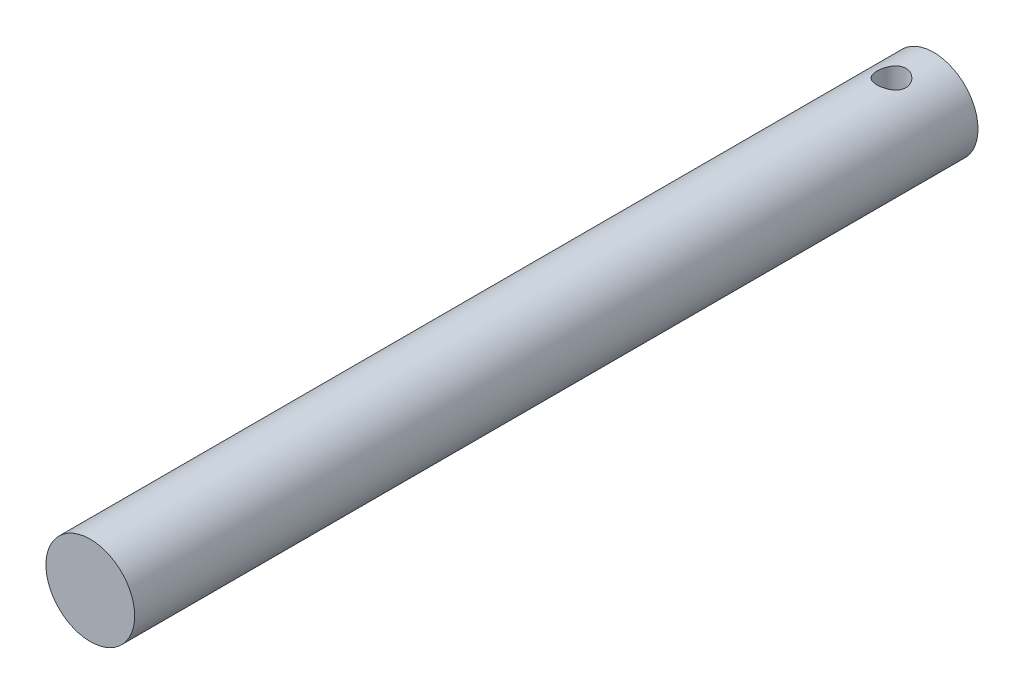
ISO-10303-21;
HEADER;
FILE_DESCRIPTION(('STEP AP214'),'2;1');
FILE_NAME('part.step','',(''),(''),'','','');
FILE_SCHEMA(('AUTOMOTIVE_DESIGN { 1 0 10303 214 1 1 1 1 }'));
ENDSEC;
DATA;
#1=APPLICATION_CONTEXT('core data for automotive mechanical design processes');
#2=APPLICATION_PROTOCOL_DEFINITION('international standard','automotive_design',2000,#1);
#3=PRODUCT_CONTEXT('',#1,'mechanical');
#4=PRODUCT('Part','Part','',(#3));
#5=PRODUCT_RELATED_PRODUCT_CATEGORY('part','',(#4));
#6=PRODUCT_DEFINITION_FORMATION('','',#4);
#7=PRODUCT_DEFINITION_CONTEXT('part definition',#1,'design');
#8=PRODUCT_DEFINITION('design','',#6,#7);
#9=PRODUCT_DEFINITION_SHAPE('','',#8);
#10=(LENGTH_UNIT() NAMED_UNIT(*) SI_UNIT(.MILLI.,.METRE.));
#11=(NAMED_UNIT(*) PLANE_ANGLE_UNIT() SI_UNIT($,.RADIAN.));
#12=(NAMED_UNIT(*) SI_UNIT($,.STERADIAN.) SOLID_ANGLE_UNIT());
#13=UNCERTAINTY_MEASURE_WITH_UNIT(LENGTH_MEASURE(1.E-05),#10,'distance_accuracy_value','');
#14=(GEOMETRIC_REPRESENTATION_CONTEXT(3) GLOBAL_UNCERTAINTY_ASSIGNED_CONTEXT((#13)) GLOBAL_UNIT_ASSIGNED_CONTEXT((#10,
#11,#12)) REPRESENTATION_CONTEXT('',''));
#15=CARTESIAN_POINT('',(0.,0.,0.));
#16=DIRECTION('',(0.,0.,1.));
#17=DIRECTION('',(1.,0.,0.));
#18=AXIS2_PLACEMENT_3D('',#15,#16,#17);
#19=CARTESIAN_POINT('',(0.,0.,190.));
#20=DIRECTION('',(0.,0.,-1.));
#21=DIRECTION('',(-1.,0.,0.));
#22=AXIS2_PLACEMENT_3D('',#19,#20,#21);
#23=CYLINDRICAL_SURFACE('',#22,10.);
#24=CARTESIAN_POINT('',(0.,-10.,12.75));
#25=CARTESIAN_POINT('',(0.177579382949037,-9.99999989374565,12.7499999788935));
#26=CARTESIAN_POINT('',(0.355160799428112,-9.99522579386108,12.7353980365284));
#27=CARTESIAN_POINT('',(0.705108112257464,-9.97665017824227,12.6775443332715));
#28=CARTESIAN_POINT('',(0.877473205641299,-9.96284727999528,12.6342881847613));
#29=CARTESIAN_POINT('',(1.21189182680224,-9.92771716006862,12.5207547728247));
#30=CARTESIAN_POINT('',(1.37396158278686,-9.90640214525769,12.4505213298079));
#31=CARTESIAN_POINT('',(1.68402262402101,-9.85843361438871,12.2852203482162));
#32=CARTESIAN_POINT('',(1.83201134569424,-9.83177912896556,12.1901482993111));
#33=CARTESIAN_POINT('',(2.11461081148199,-9.77495932247796,11.9745589387076));
#34=CARTESIAN_POINT('',(2.24869037174637,-9.74471295358528,11.8533668062036));
#35=CARTESIAN_POINT('',(2.49502344091046,-9.6845736848256,11.5904130339127));
#36=CARTESIAN_POINT('',(2.6072724549812,-9.65468085893924,11.4486471685403));
#37=CARTESIAN_POINT('',(2.80972801137824,-9.59775056049016,11.1438629732491));
#38=CARTESIAN_POINT('',(2.89925504445897,-9.57081237727236,10.9803729502016));
#39=CARTESIAN_POINT('',(3.049318871398,-9.52406830823476,10.6396400997919));
#40=CARTESIAN_POINT('',(3.10986401524675,-9.50426036852437,10.4624012507344));
#41=CARTESIAN_POINT('',(3.19827260971519,-9.4748706234853,10.1052240034781));
#42=CARTESIAN_POINT('',(3.2271274104268,-9.46497952226558,9.92555717035662));
#43=CARTESIAN_POINT('',(3.25443459132067,-9.45562707493594,9.56368104299375));
#44=CARTESIAN_POINT('',(3.25289582251765,-9.45616269242515,9.38147250437639));
#45=CARTESIAN_POINT('',(3.22023155138037,-9.46733131423128,9.02803492164185));
#46=CARTESIAN_POINT('',(3.19038591816139,-9.47752750417874,8.8566714242638));
#47=CARTESIAN_POINT('',(3.10403782395807,-9.50615574812355,8.52153026618225));
#48=CARTESIAN_POINT('',(3.04753231830217,-9.52458874278654,8.35775347425966));
#49=CARTESIAN_POINT('',(2.9086040418874,-9.56793440052134,8.03946972523123));
#50=CARTESIAN_POINT('',(2.82579288678077,-9.59294312913819,7.88514594174321));
#51=CARTESIAN_POINT('',(2.63687365185911,-9.64658062480913,7.59217407032713));
#52=CARTESIAN_POINT('',(2.53075911343127,-9.6752103945125,7.45353034435166));
#53=CARTESIAN_POINT('',(2.29204406554379,-9.73459644737762,7.18864419467052));
#54=CARTESIAN_POINT('',(2.15839298888212,-9.76538786414675,7.06335456075029));
#55=CARTESIAN_POINT('',(1.87159594889807,-9.82438470108506,6.83672493383306));
#56=CARTESIAN_POINT('',(1.71844829781997,-9.85258989700936,6.73538701643118));
#57=CARTESIAN_POINT('',(1.39505996296231,-9.90357541398691,6.55882041963745));
#58=CARTESIAN_POINT('',(1.22467751353947,-9.92630448856869,6.48383558140145));
#59=CARTESIAN_POINT('',(0.872803501369059,-9.96340575158467,6.36388245090137));
#60=CARTESIAN_POINT('',(0.69131562065941,-9.97778069343972,6.31890426808364));
#61=CARTESIAN_POINT('',(0.330457295677714,-9.99610319938068,6.26190268958609));
#62=CARTESIAN_POINT('',(0.151310774152583,-10.0004581918424,6.24859087614171));
#63=CARTESIAN_POINT('',(-0.206684753642986,-9.99946515119833,6.25164499537228));
#64=CARTESIAN_POINT('',(-0.385533802797546,-9.99411866512874,6.26800619627043));
#65=CARTESIAN_POINT('',(-0.732777014929081,-9.97459190888947,6.32891612541361));
#66=CARTESIAN_POINT('',(-0.901323284372865,-9.96065655544011,6.37268387411816));
#67=CARTESIAN_POINT('',(-1.22862125569252,-9.92560343144515,6.48619763987108));
#68=CARTESIAN_POINT('',(-1.38737171915065,-9.90448475494932,6.55594693377962));
#69=CARTESIAN_POINT('',(-1.69509055480488,-9.85654869030637,6.7214272702345));
#70=CARTESIAN_POINT('',(-1.84370519348154,-9.82959944293602,6.8177768248749));
#71=CARTESIAN_POINT('',(-2.12308150730875,-9.77306882676684,7.03298990397325));
#72=CARTESIAN_POINT('',(-2.25383795390917,-9.74348669127606,7.151859997817));
#73=CARTESIAN_POINT('',(-2.49964097258612,-9.68341394517995,7.41480097804423));
#74=CARTESIAN_POINT('',(-2.61376838975716,-9.65293908057767,7.55973674123745));
#75=CARTESIAN_POINT('',(-2.81618275812033,-9.59584349220032,7.86736100265518));
#76=CARTESIAN_POINT('',(-2.90446977360854,-9.56922275883548,8.03004945670606));
#77=CARTESIAN_POINT('',(-3.05222465357593,-9.52312626728824,8.3684525393954));
#78=CARTESIAN_POINT('',(-3.11177462835522,-9.50363019104654,8.54412838046303));
#79=CARTESIAN_POINT('',(-3.20020095668876,-9.47422438151486,8.90378778157255));
#80=CARTESIAN_POINT('',(-3.22909023717128,-9.4643106083648,9.08776780633169));
#81=CARTESIAN_POINT('',(-3.25439854839941,-9.45563586870718,9.44914011744297));
#82=CARTESIAN_POINT('',(-3.25233581624123,-9.45635339998916,9.62641479309743));
#83=CARTESIAN_POINT('',(-3.21950614466644,-9.46758016662914,9.97795399616682));
#84=CARTESIAN_POINT('',(-3.18874075712543,-9.47808887260453,10.1522186858048));
#85=CARTESIAN_POINT('',(-3.10043070730134,-9.50733511912922,10.4898321057282));
#86=CARTESIAN_POINT('',(-3.04335434275121,-9.52592844913925,10.6533167867785));
#87=CARTESIAN_POINT('',(-2.90441722996809,-9.5692021691022,10.9685171754486));
#88=CARTESIAN_POINT('',(-2.82255115849537,-9.59388386623479,11.1202303465038));
#89=CARTESIAN_POINT('',(-2.63235879697991,-9.64784088636398,11.4144561834634));
#90=CARTESIAN_POINT('',(-2.52306891129123,-9.67726517521805,11.5563185213747));
#91=CARTESIAN_POINT('',(-2.28278717900075,-9.73674387050347,11.8201809069832));
#92=CARTESIAN_POINT('',(-2.15178933442872,-9.76679844907541,11.9421754466285));
#93=CARTESIAN_POINT('',(-1.86608754817447,-9.82546252093759,12.1672967982182));
#94=CARTESIAN_POINT('',(-1.71069498742675,-9.85397977542082,12.2695765881428));
#95=CARTESIAN_POINT('',(-1.38400159009725,-9.90514098282108,12.4464406536773));
#96=CARTESIAN_POINT('',(-1.21270574929994,-9.92778677175249,12.5210335901562));
#97=CARTESIAN_POINT('',(-0.869832380696063,-9.96349655119001,12.6363330359905));
#98=CARTESIAN_POINT('',(-0.698908003473846,-9.97706030755102,12.6788273892005));
#99=CARTESIAN_POINT('',(-0.351988917437684,-9.9953110007797,12.7356574435725));
#100=CARTESIAN_POINT('',(-0.175995457426611,-10.0000001053066,12.7500000209183));
#101=CARTESIAN_POINT('',(0.,-10.,12.75));
#102=B_SPLINE_CURVE_WITH_KNOTS('',3,(#24,#25,#26,#27,#28,#29,#30,#31,#32,#33,#34,#35,#36,#37,
#38,#39,#40,#41,#42,#43,#44,#45,#46,#47,#48,#49,#50,#51,#52,#53,#54,#55,#56,#57,#58,#59,#60,#61,
#62,#63,#64,#65,#66,#67,#68,#69,#70,#71,#72,#73,#74,#75,#76,#77,#78,#79,#80,#81,#82,#83,#84,#85,
#86,#87,#88,#89,#90,#91,#92,#93,#94,#95,#96,#97,#98,#99,#100,#101),.UNSPECIFIED.,.T.,.F.,(4,2,2,
2,2,2,2,2,2,2,2,2,2,2,2,2,2,2,2,2,2,2,2,2,2,2,2,2,2,2,2,2,2,2,2,2,2,2,4),(0.,0.532090801254678,
1.06426309669592,1.59557459199055,2.12698263287681,2.67425296309553,3.22163585524026,
3.78384740278184,4.34589687356045,4.88981368187708,5.43357209666657,5.95386117923412,
6.47420969543027,7.0026288286568,7.53119460031028,8.08590846442153,8.64067038102186,
9.2004380558259,9.76002113320907,10.2964148728263,10.8327230844865,11.3544036147969,
11.8761499631049,12.4112318399367,12.9464700445872,13.5047604456698,14.0630494576023,
14.6197336846483,15.176183113382,15.7054311330744,16.2346505394039,16.7547941299287,
17.275049493252,17.8170673976499,18.3592353135956,18.9211107593865,19.4828102935623,
20.0102839458811,20.5376287446081),.UNSPECIFIED.);
#103=CARTESIAN_POINT('',(0.,-10.,12.75));
#104=VERTEX_POINT('',#103);
#105=EDGE_CURVE('E39',#104,#104,#102,.T.);
#106=ORIENTED_EDGE('',*,*,#105,.T.);
#107=EDGE_LOOP('',(#106));
#108=FACE_BOUND('',#107,.T.);
#109=CARTESIAN_POINT('',(0.,10.,12.75));
#110=CARTESIAN_POINT('',(-0.17757938294903,9.99999989374565,12.7499999788935));
#111=CARTESIAN_POINT('',(-0.355160799428105,9.99522579386108,12.7353980365284));
#112=CARTESIAN_POINT('',(-0.705108112257457,9.97665017824228,12.6775443332715));
#113=CARTESIAN_POINT('',(-0.877473205641292,9.96284727999529,12.6342881847613));
#114=CARTESIAN_POINT('',(-1.21189182680223,9.92771716006863,12.5207547728247));
#115=CARTESIAN_POINT('',(-1.37396158278685,9.90640214525769,12.4505213298079));
#116=CARTESIAN_POINT('',(-1.684022624021,9.85843361438871,12.2852203482162));
#117=CARTESIAN_POINT('',(-1.83201134569423,9.83177912896556,12.1901482993111));
#118=CARTESIAN_POINT('',(-2.11461081148198,9.77495932247796,11.9745589387076));
#119=CARTESIAN_POINT('',(-2.24869037174636,9.74471295358528,11.8533668062036));
#120=CARTESIAN_POINT('',(-2.49502344091045,9.6845736848256,11.5904130339127));
#121=CARTESIAN_POINT('',(-2.60727245498119,9.65468085893924,11.4486471685403));
#122=CARTESIAN_POINT('',(-2.80972801137823,9.59775056049016,11.1438629732491));
#123=CARTESIAN_POINT('',(-2.89925504445896,9.57081237727236,10.9803729502016));
#124=CARTESIAN_POINT('',(-3.04931887139799,9.52406830823476,10.6396400997919));
#125=CARTESIAN_POINT('',(-3.10986401524674,9.50426036852437,10.4624012507344));
#126=CARTESIAN_POINT('',(-3.19827260971519,9.4748706234853,10.1052240034781));
#127=CARTESIAN_POINT('',(-3.2271274104268,9.46497952226559,9.92555717035662));
#128=CARTESIAN_POINT('',(-3.25443459132067,9.45562707493594,9.56368104299375));
#129=CARTESIAN_POINT('',(-3.25289582251765,9.45616269242515,9.38147250437639));
#130=CARTESIAN_POINT('',(-3.22023155138037,9.46733131423128,9.02803492164185));
#131=CARTESIAN_POINT('',(-3.19038591816138,9.47752750417874,8.8566714242638));
#132=CARTESIAN_POINT('',(-3.10403782395806,9.50615574812356,8.52153026618225));
#133=CARTESIAN_POINT('',(-3.04753231830216,9.52458874278654,8.35775347425966));
#134=CARTESIAN_POINT('',(-2.90860404188739,9.56793440052134,8.03946972523123));
#135=CARTESIAN_POINT('',(-2.82579288678076,9.5929431291382,7.88514594174321));
#136=CARTESIAN_POINT('',(-2.6368736518591,9.64658062480913,7.59217407032713));
#137=CARTESIAN_POINT('',(-2.53075911343127,9.6752103945125,7.45353034435166));
#138=CARTESIAN_POINT('',(-2.29204406554378,9.73459644737762,7.18864419467052));
#139=CARTESIAN_POINT('',(-2.15839298888211,9.76538786414675,7.06335456075029));
#140=CARTESIAN_POINT('',(-1.87159594889806,9.82438470108506,6.83672493383306));
#141=CARTESIAN_POINT('',(-1.71844829781996,9.85258989700936,6.73538701643118));
#142=CARTESIAN_POINT('',(-1.3950599629623,9.90357541398691,6.55882041963745));
#143=CARTESIAN_POINT('',(-1.22467751353946,9.92630448856869,6.48383558140145));
#144=CARTESIAN_POINT('',(-0.872803501369051,9.96340575158467,6.36388245090137));
#145=CARTESIAN_POINT('',(-0.691315620659402,9.97778069343972,6.31890426808364));
#146=CARTESIAN_POINT('',(-0.330457295677706,9.99610319938068,6.26190268958609));
#147=CARTESIAN_POINT('',(-0.151310774152576,10.0004581918424,6.24859087614171));
#148=CARTESIAN_POINT('',(0.206684753642994,9.99946515119833,6.25164499537228));
#149=CARTESIAN_POINT('',(0.385533802797554,9.99411866512873,6.26800619627043));
#150=CARTESIAN_POINT('',(0.732777014929089,9.97459190888947,6.32891612541361));
#151=CARTESIAN_POINT('',(0.901323284372872,9.96065655544011,6.37268387411816));
#152=CARTESIAN_POINT('',(1.22862125569253,9.92560343144515,6.48619763987108));
#153=CARTESIAN_POINT('',(1.38737171915066,9.90448475494932,6.55594693377962));
#154=CARTESIAN_POINT('',(1.69509055480489,9.85654869030636,6.7214272702345));
#155=CARTESIAN_POINT('',(1.84370519348155,9.82959944293601,6.8177768248749));
#156=CARTESIAN_POINT('',(2.12308150730875,9.77306882676684,7.03298990397325));
#157=CARTESIAN_POINT('',(2.25383795390918,9.74348669127605,7.151859997817));
#158=CARTESIAN_POINT('',(2.49964097258612,9.68341394517995,7.41480097804423));
#159=CARTESIAN_POINT('',(2.61376838975717,9.65293908057767,7.55973674123745));
#160=CARTESIAN_POINT('',(2.81618275812033,9.59584349220032,7.86736100265518));
#161=CARTESIAN_POINT('',(2.90446977360854,9.56922275883548,8.03004945670606));
#162=CARTESIAN_POINT('',(3.05222465357594,9.52312626728824,8.3684525393954));
#163=CARTESIAN_POINT('',(3.11177462835522,9.50363019104654,8.54412838046303));
#164=CARTESIAN_POINT('',(3.20020095668876,9.47422438151486,8.90378778157254));
#165=CARTESIAN_POINT('',(3.22909023717129,9.4643106083648,9.08776780633168));
#166=CARTESIAN_POINT('',(3.25439854839942,9.45563586870717,9.44914011744297));
#167=CARTESIAN_POINT('',(3.25233581624124,9.45635339998916,9.62641479309743));
#168=CARTESIAN_POINT('',(3.21950614466645,9.46758016662914,9.97795399616682));
#169=CARTESIAN_POINT('',(3.18874075712544,9.47808887260453,10.1522186858048));
#170=CARTESIAN_POINT('',(3.10043070730134,9.50733511912922,10.4898321057282));
#171=CARTESIAN_POINT('',(3.04335434275122,9.52592844913925,10.6533167867785));
#172=CARTESIAN_POINT('',(2.9044172299681,9.56920216910219,10.9685171754486));
#173=CARTESIAN_POINT('',(2.82255115849538,9.59388386623479,11.1202303465038));
#174=CARTESIAN_POINT('',(2.63235879697992,9.64784088636397,11.4144561834634));
#175=CARTESIAN_POINT('',(2.52306891129124,9.67726517521804,11.5563185213747));
#176=CARTESIAN_POINT('',(2.28278717900076,9.73674387050347,11.8201809069832));
#177=CARTESIAN_POINT('',(2.15178933442872,9.76679844907541,11.9421754466285));
#178=CARTESIAN_POINT('',(1.86608754817448,9.82546252093759,12.1672967982182));
#179=CARTESIAN_POINT('',(1.71069498742676,9.85397977542082,12.2695765881428));
#180=CARTESIAN_POINT('',(1.38400159009726,9.90514098282108,12.4464406536773));
#181=CARTESIAN_POINT('',(1.21270574929995,9.92778677175249,12.5210335901562));
#182=CARTESIAN_POINT('',(0.869832380696071,9.96349655119002,12.6363330359905));
#183=CARTESIAN_POINT('',(0.698908003473853,9.97706030755102,12.6788273892005));
#184=CARTESIAN_POINT('',(0.351988917437691,9.9953110007797,12.7356574435725));
#185=CARTESIAN_POINT('',(0.175995457426618,10.0000001053066,12.7500000209183));
#186=CARTESIAN_POINT('',(0.,10.,12.75));
#187=B_SPLINE_CURVE_WITH_KNOTS('',3,(#109,#110,#111,#112,#113,#114,#115,#116,#117,#118,#119,
#120,#121,#122,#123,#124,#125,#126,#127,#128,#129,#130,#131,#132,#133,#134,#135,#136,#137,#138,
#139,#140,#141,#142,#143,#144,#145,#146,#147,#148,#149,#150,#151,#152,#153,#154,#155,#156,#157,
#158,#159,#160,#161,#162,#163,#164,#165,#166,#167,#168,#169,#170,#171,#172,#173,#174,#175,#176,
#177,#178,#179,#180,#181,#182,#183,#184,#185,#186),.UNSPECIFIED.,.T.,.F.,(4,2,2,2,2,2,2,2,2,2,2,
2,2,2,2,2,2,2,2,2,2,2,2,2,2,2,2,2,2,2,2,2,2,2,2,2,2,2,4),(0.,0.532090801254678,1.06426309669592,
1.59557459199055,2.12698263287681,2.67425296309553,3.22163585524026,3.78384740278184,
4.34589687356045,4.88981368187708,5.43357209666657,5.95386117923412,6.47420969543027,
7.0026288286568,7.53119460031028,8.08590846442153,8.64067038102186,9.2004380558259,
9.76002113320907,10.2964148728263,10.8327230844865,11.3544036147969,11.8761499631049,
12.4112318399367,12.9464700445872,13.5047604456698,14.0630494576023,14.6197336846483,
15.176183113382,15.7054311330744,16.2346505394039,16.7547941299287,17.275049493252,
17.8170673976499,18.3592353135956,18.9211107593865,19.4828102935623,20.0102839458811,
20.5376287446081),.UNSPECIFIED.);
#188=CARTESIAN_POINT('',(0.,10.,12.75));
#189=VERTEX_POINT('',#188);
#190=EDGE_CURVE('E52',#189,#189,#187,.T.);
#191=ORIENTED_EDGE('',*,*,#190,.T.);
#192=EDGE_LOOP('',(#191));
#193=FACE_BOUND('',#192,.T.);
#194=CARTESIAN_POINT('',(0.,0.,190.));
#195=DIRECTION('',(0.,0.,1.));
#196=DIRECTION('',(1.,0.,0.));
#197=AXIS2_PLACEMENT_3D('',#194,#195,#196);
#198=CIRCLE('',#197,10.);
#199=CARTESIAN_POINT('',(10.,0.,190.));
#200=VERTEX_POINT('',#199);
#201=EDGE_CURVE('E10',#200,#200,#198,.T.);
#202=ORIENTED_EDGE('',*,*,#201,.F.);
#203=EDGE_LOOP('',(#202));
#204=FACE_BOUND('',#203,.T.);
#205=CARTESIAN_POINT('',(0.,0.,0.));
#206=DIRECTION('',(0.,0.,1.));
#207=DIRECTION('',(1.,0.,0.));
#208=AXIS2_PLACEMENT_3D('',#205,#206,#207);
#209=CIRCLE('',#208,10.);
#210=CARTESIAN_POINT('',(10.,0.,0.));
#211=VERTEX_POINT('',#210);
#212=EDGE_CURVE('E46',#211,#211,#209,.T.);
#213=ORIENTED_EDGE('',*,*,#212,.T.);
#214=EDGE_LOOP('',(#213));
#215=FACE_BOUND('',#214,.T.);
#216=ADVANCED_FACE('F35',(#108,#193,#204,#215),#23,.T.);
#217=CARTESIAN_POINT('',(0.,0.,190.));
#218=DIRECTION('',(0.,0.,1.));
#219=DIRECTION('',(1.,0.,0.));
#220=AXIS2_PLACEMENT_3D('',#217,#218,#219);
#221=PLANE('',#220);
#222=ORIENTED_EDGE('',*,*,#201,.T.);
#223=EDGE_LOOP('',(#222));
#224=FACE_BOUND('',#223,.T.);
#225=ADVANCED_FACE('F62',(#224),#221,.T.);
#226=CARTESIAN_POINT('',(0.,0.,0.));
#227=DIRECTION('',(0.,0.,1.));
#228=DIRECTION('',(1.,0.,0.));
#229=AXIS2_PLACEMENT_3D('',#226,#227,#228);
#230=PLANE('',#229);
#231=ORIENTED_EDGE('',*,*,#212,.F.);
#232=EDGE_LOOP('',(#231));
#233=FACE_BOUND('',#232,.T.);
#234=ADVANCED_FACE('F60',(#233),#230,.F.);
#235=CARTESIAN_POINT('',(0.,-210.,9.5));
#236=DIRECTION('',(0.,1.,0.));
#237=DIRECTION('',(0.,0.,1.));
#238=AXIS2_PLACEMENT_3D('',#235,#236,#237);
#239=CYLINDRICAL_SURFACE('',#238,3.25);
#240=ORIENTED_EDGE('',*,*,#190,.F.);
#241=EDGE_LOOP('',(#240));
#242=FACE_BOUND('',#241,.T.);
#243=ORIENTED_EDGE('',*,*,#105,.F.);
#244=EDGE_LOOP('',(#243));
#245=FACE_BOUND('',#244,.T.);
#246=ADVANCED_FACE('F56',(#242,#245),#239,.F.);
#247=CLOSED_SHELL('',(#216,#225,#234,#246));
#248=MANIFOLD_SOLID_BREP('B2',#247);
#249=ADVANCED_BREP_SHAPE_REPRESENTATION('',(#18,#248),#14);
#250=SHAPE_DEFINITION_REPRESENTATION(#9,#249);
ENDSEC;
END-ISO-10303-21;
